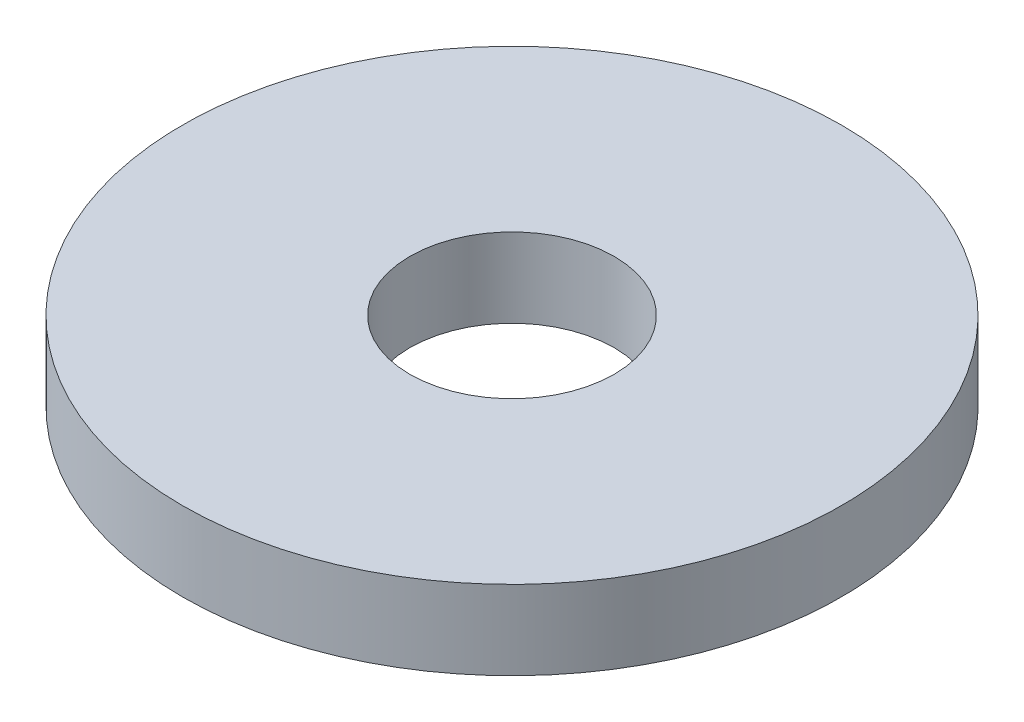
ISO-10303-21;
HEADER;
FILE_DESCRIPTION(('STEP AP214'),'2;1');
FILE_NAME('part.step','',(''),(''),'','','');
FILE_SCHEMA(('AUTOMOTIVE_DESIGN { 1 0 10303 214 1 1 1 1 }'));
ENDSEC;
DATA;
#1=APPLICATION_CONTEXT('core data for automotive mechanical design processes');
#2=APPLICATION_PROTOCOL_DEFINITION('international standard','automotive_design',2000,#1);
#3=PRODUCT_CONTEXT('',#1,'mechanical');
#4=PRODUCT('Part','Part','',(#3));
#5=PRODUCT_RELATED_PRODUCT_CATEGORY('part','',(#4));
#6=PRODUCT_DEFINITION_FORMATION('','',#4);
#7=PRODUCT_DEFINITION_CONTEXT('part definition',#1,'design');
#8=PRODUCT_DEFINITION('design','',#6,#7);
#9=PRODUCT_DEFINITION_SHAPE('','',#8);
#10=(LENGTH_UNIT() NAMED_UNIT(*) SI_UNIT(.MILLI.,.METRE.));
#11=(NAMED_UNIT(*) PLANE_ANGLE_UNIT() SI_UNIT($,.RADIAN.));
#12=(NAMED_UNIT(*) SI_UNIT($,.STERADIAN.) SOLID_ANGLE_UNIT());
#13=UNCERTAINTY_MEASURE_WITH_UNIT(LENGTH_MEASURE(1.E-05),#10,'distance_accuracy_value','');
#14=(GEOMETRIC_REPRESENTATION_CONTEXT(3) GLOBAL_UNCERTAINTY_ASSIGNED_CONTEXT((#13)) GLOBAL_UNIT_ASSIGNED_CONTEXT((#10,
#11,#12)) REPRESENTATION_CONTEXT('',''));
#15=CARTESIAN_POINT('',(0.,0.,0.));
#16=DIRECTION('',(0.,0.,1.));
#17=DIRECTION('',(1.,0.,0.));
#18=AXIS2_PLACEMENT_3D('',#15,#16,#17);
#19=CARTESIAN_POINT('',(0.,1.2,0.));
#20=DIRECTION('',(0.,1.,0.));
#21=DIRECTION('',(0.,0.,1.));
#22=AXIS2_PLACEMENT_3D('',#19,#20,#21);
#23=PLANE('',#22);
#24=CARTESIAN_POINT('',(0.,1.2,0.));
#25=DIRECTION('',(0.,1.,0.));
#26=DIRECTION('',(0.,0.,1.));
#27=AXIS2_PLACEMENT_3D('',#24,#25,#26);
#28=CIRCLE('',#27,5.);
#29=CARTESIAN_POINT('',(0.,1.2,5.));
#30=VERTEX_POINT('',#29);
#31=EDGE_CURVE('E10',#30,#30,#28,.T.);
#32=ORIENTED_EDGE('',*,*,#31,.T.);
#33=EDGE_LOOP('',(#32));
#34=FACE_BOUND('',#33,.T.);
#35=CARTESIAN_POINT('',(0.,1.2,0.));
#36=DIRECTION('',(0.,1.,0.));
#37=DIRECTION('',(0.,0.,1.));
#38=AXIS2_PLACEMENT_3D('',#35,#36,#37);
#39=CIRCLE('',#38,1.55);
#40=CARTESIAN_POINT('',(0.,1.2,1.55));
#41=VERTEX_POINT('',#40);
#42=EDGE_CURVE('E42',#41,#41,#39,.T.);
#43=ORIENTED_EDGE('',*,*,#42,.F.);
#44=EDGE_LOOP('',(#43));
#45=FACE_BOUND('',#44,.T.);
#46=ADVANCED_FACE('F31',(#34,#45),#23,.T.);
#47=CARTESIAN_POINT('',(0.,0.,0.));
#48=DIRECTION('',(0.,1.,0.));
#49=DIRECTION('',(0.,0.,1.));
#50=AXIS2_PLACEMENT_3D('',#47,#48,#49);
#51=PLANE('',#50);
#52=CARTESIAN_POINT('',(0.,0.,0.));
#53=DIRECTION('',(0.,1.,0.));
#54=DIRECTION('',(0.,0.,1.));
#55=AXIS2_PLACEMENT_3D('',#52,#53,#54);
#56=CIRCLE('',#55,5.);
#57=CARTESIAN_POINT('',(0.,0.,5.));
#58=VERTEX_POINT('',#57);
#59=EDGE_CURVE('E35',#58,#58,#56,.T.);
#60=ORIENTED_EDGE('',*,*,#59,.F.);
#61=EDGE_LOOP('',(#60));
#62=FACE_BOUND('',#61,.T.);
#63=CARTESIAN_POINT('',(0.,0.,0.));
#64=DIRECTION('',(0.,1.,0.));
#65=DIRECTION('',(0.,0.,1.));
#66=AXIS2_PLACEMENT_3D('',#63,#64,#65);
#67=CIRCLE('',#66,1.55);
#68=CARTESIAN_POINT('',(0.,0.,1.55));
#69=VERTEX_POINT('',#68);
#70=EDGE_CURVE('E44',#69,#69,#67,.T.);
#71=ORIENTED_EDGE('',*,*,#70,.T.);
#72=EDGE_LOOP('',(#71));
#73=FACE_BOUND('',#72,.T.);
#74=ADVANCED_FACE('F54',(#62,#73),#51,.F.);
#75=CARTESIAN_POINT('',(0.,1.2,0.));
#76=DIRECTION('',(0.,-1.,0.));
#77=DIRECTION('',(0.,0.,-1.));
#78=AXIS2_PLACEMENT_3D('',#75,#76,#77);
#79=CYLINDRICAL_SURFACE('',#78,5.);
#80=ORIENTED_EDGE('',*,*,#31,.F.);
#81=EDGE_LOOP('',(#80));
#82=FACE_BOUND('',#81,.T.);
#83=ORIENTED_EDGE('',*,*,#59,.T.);
#84=EDGE_LOOP('',(#83));
#85=FACE_BOUND('',#84,.T.);
#86=ADVANCED_FACE('F33',(#82,#85),#79,.T.);
#87=CARTESIAN_POINT('',(0.,1.2,0.));
#88=DIRECTION('',(0.,-1.,0.));
#89=DIRECTION('',(0.,0.,-1.));
#90=AXIS2_PLACEMENT_3D('',#87,#88,#89);
#91=CYLINDRICAL_SURFACE('',#90,1.55);
#92=ORIENTED_EDGE('',*,*,#42,.T.);
#93=EDGE_LOOP('',(#92));
#94=FACE_BOUND('',#93,.T.);
#95=ORIENTED_EDGE('',*,*,#70,.F.);
#96=EDGE_LOOP('',(#95));
#97=FACE_BOUND('',#96,.T.);
#98=ADVANCED_FACE('F50',(#94,#97),#91,.F.);
#99=CLOSED_SHELL('',(#46,#74,#86,#98));
#100=MANIFOLD_SOLID_BREP('B2',#99);
#101=ADVANCED_BREP_SHAPE_REPRESENTATION('',(#18,#100),#14);
#102=SHAPE_DEFINITION_REPRESENTATION(#9,#101);
ENDSEC;
END-ISO-10303-21;
